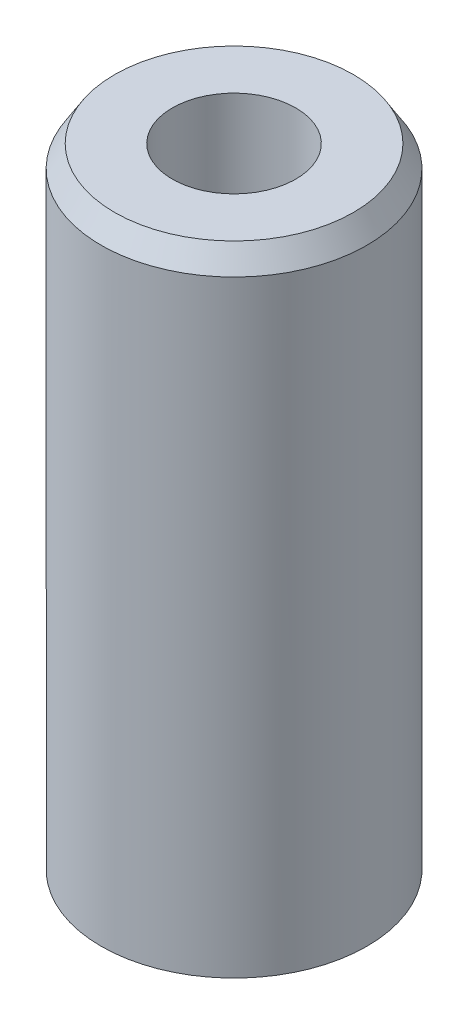
ISO-10303-21;
HEADER;
FILE_DESCRIPTION(('STEP AP214'),'2;1');
FILE_NAME('part.step','',(''),(''),'','','');
FILE_SCHEMA(('AUTOMOTIVE_DESIGN { 1 0 10303 214 1 1 1 1 }'));
ENDSEC;
DATA;
#1=APPLICATION_CONTEXT('core data for automotive mechanical design processes');
#2=APPLICATION_PROTOCOL_DEFINITION('international standard','automotive_design',2000,#1);
#3=PRODUCT_CONTEXT('',#1,'mechanical');
#4=PRODUCT('Part','Part','',(#3));
#5=PRODUCT_RELATED_PRODUCT_CATEGORY('part','',(#4));
#6=PRODUCT_DEFINITION_FORMATION('','',#4);
#7=PRODUCT_DEFINITION_CONTEXT('part definition',#1,'design');
#8=PRODUCT_DEFINITION('design','',#6,#7);
#9=PRODUCT_DEFINITION_SHAPE('','',#8);
#10=(LENGTH_UNIT() NAMED_UNIT(*) SI_UNIT(.MILLI.,.METRE.));
#11=(NAMED_UNIT(*) PLANE_ANGLE_UNIT() SI_UNIT($,.RADIAN.));
#12=(NAMED_UNIT(*) SI_UNIT($,.STERADIAN.) SOLID_ANGLE_UNIT());
#13=UNCERTAINTY_MEASURE_WITH_UNIT(LENGTH_MEASURE(1.E-05),#10,'distance_accuracy_value','');
#14=(GEOMETRIC_REPRESENTATION_CONTEXT(3) GLOBAL_UNCERTAINTY_ASSIGNED_CONTEXT((#13)) GLOBAL_UNIT_ASSIGNED_CONTEXT((#10,
#11,#12)) REPRESENTATION_CONTEXT('',''));
#15=CARTESIAN_POINT('',(0.,0.,0.));
#16=DIRECTION('',(0.,0.,1.));
#17=DIRECTION('',(1.,0.,0.));
#18=AXIS2_PLACEMENT_3D('',#15,#16,#17);
#19=CARTESIAN_POINT('',(0.,96.6680046645585,0.));
#20=DIRECTION('',(0.,-1.,0.));
#21=DIRECTION('',(0.,0.,-1.));
#22=AXIS2_PLACEMENT_3D('',#19,#20,#21);
#23=CYLINDRICAL_SURFACE('',#22,20.);
#24=CARTESIAN_POINT('',(0.,93.4012086567926,0.));
#25=DIRECTION('',(0.,1.,0.));
#26=DIRECTION('',(0.,0.,1.));
#27=AXIS2_PLACEMENT_3D('',#24,#25,#26);
#28=CIRCLE('',#27,20.);
#29=CARTESIAN_POINT('',(0.,93.4012086567926,-20.));
#30=VERTEX_POINT('',#29);
#31=EDGE_CURVE('E50',#30,#30,#28,.F.);
#32=CARTESIAN_POINT('',(0.,2.02536451260532,0.));
#33=DIRECTION('',(0.,1.,0.));
#34=DIRECTION('',(0.,0.,1.));
#35=AXIS2_PLACEMENT_3D('',#32,#33,#34);
#36=CIRCLE('',#35,20.);
#37=CARTESIAN_POINT('',(0.,2.02536451260532,-20.));
#38=VERTEX_POINT('',#37);
#39=EDGE_CURVE('E51',#38,#38,#36,.T.);
#40=CARTESIAN_POINT('',(0.,93.4012086567926,-20.));
#41=CARTESIAN_POINT('',(0.,92.4493769469573,-20.));
#42=CARTESIAN_POINT('',(0.,91.497545237122,-20.));
#43=CARTESIAN_POINT('',(0.,89.5938818174514,-20.));
#44=CARTESIAN_POINT('',(0.,88.6420501076162,-20.));
#45=CARTESIAN_POINT('',(0.,86.7383866879456,-20.));
#46=CARTESIAN_POINT('',(0.,85.7865549781103,-20.));
#47=CARTESIAN_POINT('',(0.,83.8828915584397,-20.));
#48=CARTESIAN_POINT('',(0.,82.9310598486044,-20.));
#49=CARTESIAN_POINT('',(0.,81.0273964289339,-20.));
#50=CARTESIAN_POINT('',(0.,80.0755647190986,-20.));
#51=CARTESIAN_POINT('',(0.,78.171901299428,-20.));
#52=CARTESIAN_POINT('',(0.,77.2200695895928,-20.));
#53=CARTESIAN_POINT('',(0.,75.3164061699222,-20.));
#54=CARTESIAN_POINT('',(0.,74.3645744600869,-20.));
#55=CARTESIAN_POINT('',(0.,72.4609110404163,-20.));
#56=CARTESIAN_POINT('',(0.,71.509079330581,-20.));
#57=CARTESIAN_POINT('',(0.,69.6054159109105,-20.));
#58=CARTESIAN_POINT('',(0.,68.6535842010752,-20.));
#59=CARTESIAN_POINT('',(0.,66.7499207814046,-20.));
#60=CARTESIAN_POINT('',(0.,65.7980890715693,-20.));
#61=CARTESIAN_POINT('',(0.,63.8944256518988,-20.));
#62=CARTESIAN_POINT('',(0.,62.9425939420635,-20.));
#63=CARTESIAN_POINT('',(0.,61.0389305223929,-20.));
#64=CARTESIAN_POINT('',(0.,60.0870988125576,-20.));
#65=CARTESIAN_POINT('',(0.,58.1834353928871,-20.));
#66=CARTESIAN_POINT('',(0.,57.2316036830518,-20.));
#67=CARTESIAN_POINT('',(0.,55.3279402633812,-20.));
#68=CARTESIAN_POINT('',(0.,54.3761085535459,-20.));
#69=CARTESIAN_POINT('',(0.,52.4724451338754,-20.));
#70=CARTESIAN_POINT('',(0.,51.5206134240401,-20.));
#71=CARTESIAN_POINT('',(0.,49.6169500043695,-20.));
#72=CARTESIAN_POINT('',(0.,48.6651182945342,-20.));
#73=CARTESIAN_POINT('',(0.,46.7614548748637,-20.));
#74=CARTESIAN_POINT('',(0.,45.8096231650284,-20.));
#75=CARTESIAN_POINT('',(0.,43.9059597453578,-20.));
#76=CARTESIAN_POINT('',(0.,42.9541280355225,-20.));
#77=CARTESIAN_POINT('',(0.,41.050464615852,-20.));
#78=CARTESIAN_POINT('',(0.,40.0986329060167,-20.));
#79=CARTESIAN_POINT('',(0.,38.1949694863461,-20.));
#80=CARTESIAN_POINT('',(0.,37.2431377765108,-20.));
#81=CARTESIAN_POINT('',(0.,35.3394743568403,-20.));
#82=CARTESIAN_POINT('',(0.,34.387642647005,-20.));
#83=CARTESIAN_POINT('',(0.,32.4839792273344,-20.));
#84=CARTESIAN_POINT('',(0.,31.5321475174991,-20.));
#85=CARTESIAN_POINT('',(0.,29.6284840978286,-20.));
#86=CARTESIAN_POINT('',(0.,28.6766523879933,-20.));
#87=CARTESIAN_POINT('',(0.,26.7729889683227,-20.));
#88=CARTESIAN_POINT('',(0.,25.8211572584874,-20.));
#89=CARTESIAN_POINT('',(0.,23.9174938388168,-20.));
#90=CARTESIAN_POINT('',(0.,22.9656621289816,-20.));
#91=CARTESIAN_POINT('',(0.,21.061998709311,-20.));
#92=CARTESIAN_POINT('',(0.,20.1101669994757,-20.));
#93=CARTESIAN_POINT('',(0.,18.2065035798052,-20.));
#94=CARTESIAN_POINT('',(0.,17.2546718699699,-20.));
#95=CARTESIAN_POINT('',(0.,15.3510084502993,-20.));
#96=CARTESIAN_POINT('',(0.,14.399176740464,-20.));
#97=CARTESIAN_POINT('',(0.,12.4955133207934,-20.));
#98=CARTESIAN_POINT('',(0.,11.5436816109582,-20.));
#99=CARTESIAN_POINT('',(0.,9.64001819128759,-20.));
#100=CARTESIAN_POINT('',(0.,8.6881864814523,-20.));
#101=CARTESIAN_POINT('',(0.,6.78452306178174,-20.));
#102=CARTESIAN_POINT('',(0.,5.83269135194645,-20.));
#103=CARTESIAN_POINT('',(0.,3.92902793227589,-20.));
#104=CARTESIAN_POINT('',(0.,2.97719622244061,-20.));
#105=CARTESIAN_POINT('',(0.,2.02536451260532,-20.));
#106=B_SPLINE_CURVE_WITH_KNOTS('',3,(#40,#41,#42,#43,#44,#45,#46,#47,#48,#49,#50,#51,#52,#53,
#54,#55,#56,#57,#58,#59,#60,#61,#62,#63,#64,#65,#66,#67,#68,#69,#70,#71,#72,#73,#74,#75,#76,#77,
#78,#79,#80,#81,#82,#83,#84,#85,#86,#87,#88,#89,#90,#91,#92,#93,#94,#95,#96,#97,#98,#99,#100,
#101,#102,#103,#104,#105),.UNSPECIFIED.,.F.,.F.,(4,2,2,2,2,2,2,2,2,2,2,2,2,2,2,2,2,2,2,2,2,2,2,
2,2,2,2,2,2,2,2,2,4),(0.,2.85549512950585,5.7109902590117,8.56648538851755,11.4219805180234,
14.2774756475293,17.1329707770351,19.9884659065409,22.8439610360468,25.6994561655527,
28.5549512950585,31.4104464245644,34.2659415540702,37.1214366835761,39.9769318130819,
42.8324269425878,45.6879220720936,48.5434172015995,51.3989123311053,54.2544074606112,
57.109902590117,59.9653977196229,62.8208928491287,65.6763879786346,68.5318831081404,
71.3873782376463,74.2428733671521,77.098368496658,79.9538636261638,82.8093587556697,
85.6648538851755,88.5203490146814,91.3758441441872),.UNSPECIFIED.);
#107=EDGE_CURVE('BSEAM39',#30,#38,#106,.T.);
#108=ORIENTED_EDGE('',*,*,#31,.T.);
#109=ORIENTED_EDGE('',*,*,#39,.T.);
#110=ORIENTED_EDGE('',*,*,#107,.T.);
#111=ORIENTED_EDGE('',*,*,#107,.F.);
#112=EDGE_LOOP('',(#108,#110,#109,#111));
#113=FACE_BOUND('',#112,.T.);
#114=ADVANCED_FACE('F39',(#113),#23,.T.);
#115=CARTESIAN_POINT('',(0.,96.6680046645585,0.));
#116=DIRECTION('',(0.,1.,0.));
#117=DIRECTION('',(0.,0.,1.));
#118=AXIS2_PLACEMENT_3D('',#115,#116,#117);
#119=PLANE('',#118);
#120=CARTESIAN_POINT('',(0.,96.6680046645585,0.));
#121=DIRECTION('',(0.,1.,0.));
#122=DIRECTION('',(0.,0.,1.));
#123=AXIS2_PLACEMENT_3D('',#120,#121,#122);
#124=CIRCLE('',#123,17.9746354873948);
#125=CARTESIAN_POINT('',(0.,96.6680046645585,17.9746354873948));
#126=VERTEX_POINT('',#125);
#127=EDGE_CURVE('E54',#126,#126,#124,.T.);
#128=ORIENTED_EDGE('',*,*,#127,.T.);
#129=EDGE_LOOP('',(#128));
#130=FACE_BOUND('',#129,.T.);
#131=CARTESIAN_POINT('',(0.,96.6680046645585,0.));
#132=DIRECTION('',(0.,1.,0.));
#133=DIRECTION('',(0.,0.,1.));
#134=AXIS2_PLACEMENT_3D('',#131,#132,#133);
#135=CIRCLE('',#134,9.29260788548895);
#136=CARTESIAN_POINT('',(0.,96.6680046645585,-9.29260788548895));
#137=VERTEX_POINT('',#136);
#138=EDGE_CURVE('E58',#137,#137,#135,.T.);
#139=ORIENTED_EDGE('',*,*,#138,.F.);
#140=EDGE_LOOP('',(#139));
#141=FACE_BOUND('',#140,.T.);
#142=ADVANCED_FACE('F69',(#130,#141),#119,.T.);
#143=CARTESIAN_POINT('',(0.,0.,0.));
#144=DIRECTION('',(0.,1.,0.));
#145=DIRECTION('',(0.,0.,1.));
#146=AXIS2_PLACEMENT_3D('',#143,#144,#145);
#147=PLANE('',#146);
#148=CARTESIAN_POINT('',(0.,0.,0.));
#149=DIRECTION('',(0.,1.,0.));
#150=DIRECTION('',(0.,0.,1.));
#151=AXIS2_PLACEMENT_3D('',#148,#149,#150);
#152=CIRCLE('',#151,16.7332039922339);
#153=CARTESIAN_POINT('',(0.,0.,16.7332039922339));
#154=VERTEX_POINT('',#153);
#155=EDGE_CURVE('E10',#154,#154,#152,.F.);
#156=ORIENTED_EDGE('',*,*,#155,.T.);
#157=EDGE_LOOP('',(#156));
#158=FACE_BOUND('',#157,.T.);
#159=CARTESIAN_POINT('',(0.,0.,0.));
#160=DIRECTION('',(0.,1.,0.));
#161=DIRECTION('',(0.,0.,1.));
#162=AXIS2_PLACEMENT_3D('',#159,#160,#161);
#163=CIRCLE('',#162,9.29260788548895);
#164=CARTESIAN_POINT('',(0.,0.,-9.29260788548895));
#165=VERTEX_POINT('',#164);
#166=EDGE_CURVE('E63',#165,#165,#163,.T.);
#167=ORIENTED_EDGE('',*,*,#166,.T.);
#168=EDGE_LOOP('',(#167));
#169=FACE_BOUND('',#168,.T.);
#170=ADVANCED_FACE('F75',(#158,#169),#147,.F.);
#171=CARTESIAN_POINT('',(0.,96.6680046645585,0.));
#172=DIRECTION('',(0.,-1.,0.));
#173=DIRECTION('',(0.,0.,-1.));
#174=AXIS2_PLACEMENT_3D('',#171,#172,#173);
#175=CYLINDRICAL_SURFACE('',#174,9.29260788548895);
#176=CARTESIAN_POINT('',(0.,96.6680046645585,-9.29260788548895));
#177=CARTESIAN_POINT('',(0.,95.661046282636,-9.29260788548895));
#178=CARTESIAN_POINT('',(0.,94.6540879007136,-9.29260788548895));
#179=CARTESIAN_POINT('',(0.,92.6401711368686,-9.29260788548895));
#180=CARTESIAN_POINT('',(0.,91.6332127549461,-9.29260788548895));
#181=CARTESIAN_POINT('',(0.,89.6192959911011,-9.29260788548895));
#182=CARTESIAN_POINT('',(0.,88.6123376091787,-9.29260788548895));
#183=CARTESIAN_POINT('',(0.,86.5984208453337,-9.29260788548895));
#184=CARTESIAN_POINT('',(0.,85.5914624634112,-9.29260788548895));
#185=CARTESIAN_POINT('',(0.,83.5775456995662,-9.29260788548895));
#186=CARTESIAN_POINT('',(0.,82.5705873176437,-9.29260788548895));
#187=CARTESIAN_POINT('',(0.,80.5566705537988,-9.29260788548895));
#188=CARTESIAN_POINT('',(0.,79.5497121718763,-9.29260788548895));
#189=CARTESIAN_POINT('',(0.,77.5357954080313,-9.29260788548895));
#190=CARTESIAN_POINT('',(0.,76.5288370261088,-9.29260788548895));
#191=CARTESIAN_POINT('',(0.,74.5149202622639,-9.29260788548895));
#192=CARTESIAN_POINT('',(0.,73.5079618803414,-9.29260788548895));
#193=CARTESIAN_POINT('',(0.,71.4940451164964,-9.29260788548895));
#194=CARTESIAN_POINT('',(0.,70.4870867345739,-9.29260788548895));
#195=CARTESIAN_POINT('',(0.,68.473169970729,-9.29260788548895));
#196=CARTESIAN_POINT('',(0.,67.4662115888065,-9.29260788548895));
#197=CARTESIAN_POINT('',(0.,65.4522948249615,-9.29260788548895));
#198=CARTESIAN_POINT('',(0.,64.445336443039,-9.29260788548895));
#199=CARTESIAN_POINT('',(0.,62.4314196791941,-9.29260788548895));
#200=CARTESIAN_POINT('',(0.,61.4244612972716,-9.29260788548895));
#201=CARTESIAN_POINT('',(0.,59.4105445334266,-9.29260788548895));
#202=CARTESIAN_POINT('',(0.,58.4035861515041,-9.29260788548895));
#203=CARTESIAN_POINT('',(0.,56.3896693876591,-9.29260788548895));
#204=CARTESIAN_POINT('',(0.,55.3827110057367,-9.29260788548895));
#205=CARTESIAN_POINT('',(0.,53.3687942418917,-9.29260788548895));
#206=CARTESIAN_POINT('',(0.,52.3618358599692,-9.29260788548895));
#207=CARTESIAN_POINT('',(0.,50.3479190961242,-9.29260788548895));
#208=CARTESIAN_POINT('',(0.,49.3409607142017,-9.29260788548895));
#209=CARTESIAN_POINT('',(0.,47.3270439503568,-9.29260788548895));
#210=CARTESIAN_POINT('',(0.,46.3200855684343,-9.29260788548895));
#211=CARTESIAN_POINT('',(0.,44.3061688045893,-9.29260788548895));
#212=CARTESIAN_POINT('',(0.,43.2992104226668,-9.29260788548895));
#213=CARTESIAN_POINT('',(0.,41.2852936588219,-9.29260788548895));
#214=CARTESIAN_POINT('',(0.,40.2783352768994,-9.29260788548895));
#215=CARTESIAN_POINT('',(0.,38.2644185130544,-9.29260788548895));
#216=CARTESIAN_POINT('',(0.,37.2574601311319,-9.29260788548895));
#217=CARTESIAN_POINT('',(0.,35.243543367287,-9.29260788548895));
#218=CARTESIAN_POINT('',(0.,34.2365849853645,-9.29260788548895));
#219=CARTESIAN_POINT('',(0.,32.2226682215195,-9.29260788548895));
#220=CARTESIAN_POINT('',(0.,31.215709839597,-9.29260788548895));
#221=CARTESIAN_POINT('',(0.,29.2017930757521,-9.29260788548895));
#222=CARTESIAN_POINT('',(0.,28.1948346938296,-9.29260788548895));
#223=CARTESIAN_POINT('',(0.,26.1809179299846,-9.29260788548895));
#224=CARTESIAN_POINT('',(0.,25.1739595480621,-9.29260788548895));
#225=CARTESIAN_POINT('',(0.,23.1600427842172,-9.29260788548895));
#226=CARTESIAN_POINT('',(0.,22.1530844022947,-9.29260788548895));
#227=CARTESIAN_POINT('',(0.,20.1391676384497,-9.29260788548895));
#228=CARTESIAN_POINT('',(0.,19.1322092565272,-9.29260788548895));
#229=CARTESIAN_POINT('',(0.,17.1182924926822,-9.29260788548895));
#230=CARTESIAN_POINT('',(0.,16.1113341107598,-9.29260788548895));
#231=CARTESIAN_POINT('',(0.,14.0974173469148,-9.29260788548895));
#232=CARTESIAN_POINT('',(0.,13.0904589649923,-9.29260788548895));
#233=CARTESIAN_POINT('',(0.,11.0765422011473,-9.29260788548895));
#234=CARTESIAN_POINT('',(0.,10.0695838192248,-9.29260788548895));
#235=CARTESIAN_POINT('',(0.,8.05566705537988,-9.29260788548895));
#236=CARTESIAN_POINT('',(0.,7.04870867345739,-9.29260788548895));
#237=CARTESIAN_POINT('',(0.,5.03479190961242,-9.29260788548895));
#238=CARTESIAN_POINT('',(0.,4.02783352768994,-9.29260788548895));
#239=CARTESIAN_POINT('',(0.,2.01391676384497,-9.29260788548895));
#240=CARTESIAN_POINT('',(0.,1.00695838192249,-9.29260788548895));
#241=CARTESIAN_POINT('',(0.,0.,-9.29260788548895));
#242=B_SPLINE_CURVE_WITH_KNOTS('',3,(#176,#177,#178,#179,#180,#181,#182,#183,#184,#185,#186,
#187,#188,#189,#190,#191,#192,#193,#194,#195,#196,#197,#198,#199,#200,#201,#202,#203,#204,#205,
#206,#207,#208,#209,#210,#211,#212,#213,#214,#215,#216,#217,#218,#219,#220,#221,#222,#223,#224,
#225,#226,#227,#228,#229,#230,#231,#232,#233,#234,#235,#236,#237,#238,#239,#240,#241),
.UNSPECIFIED.,.F.,.F.,(4,2,2,2,2,2,2,2,2,2,2,2,2,2,2,2,2,2,2,2,2,2,2,2,2,2,2,2,2,2,2,2,4),(0.,
3.02087514576745,6.04175029153491,9.06262543730235,12.0835005830698,15.1043757288373,
18.1252508746047,21.1461260203722,24.1670011661396,27.1878763119071,30.2087514576745,
33.229626603442,36.2505017492094,39.2713768949769,42.2922520407443,45.3131271865118,
48.3340023322793,51.3548774780467,54.3757526238142,57.3966277695816,60.4175029153491,
63.4383780611165,66.459253206884,69.4801283526514,72.5010034984189,75.5218786441863,
78.5427537899538,81.5636289357213,84.5845040814887,87.6053792272562,90.6262543730236,
93.6471295187911,96.6680046645585),.UNSPECIFIED.);
#243=EDGE_CURVE('BSEAM70',#137,#165,#242,.T.);
#244=ORIENTED_EDGE('',*,*,#138,.T.);
#245=ORIENTED_EDGE('',*,*,#166,.F.);
#246=ORIENTED_EDGE('',*,*,#243,.T.);
#247=ORIENTED_EDGE('',*,*,#243,.F.);
#248=EDGE_LOOP('',(#244,#246,#245,#247));
#249=FACE_BOUND('',#248,.T.);
#250=ADVANCED_FACE('F70',(#249),#175,.F.);
#251=CARTESIAN_POINT('',(0.,96.6680046645585,0.));
#252=DIRECTION('',(0.,-1.,0.));
#253=DIRECTION('',(0.,0.,-1.));
#254=AXIS2_PLACEMENT_3D('',#251,#252,#253);
#255=CONICAL_SURFACE('',#254,17.9746354873948,0.554984889976249);
#256=ORIENTED_EDGE('',*,*,#31,.F.);
#257=EDGE_LOOP('',(#256));
#258=FACE_BOUND('',#257,.T.);
#259=ORIENTED_EDGE('',*,*,#127,.F.);
#260=EDGE_LOOP('',(#259));
#261=FACE_BOUND('',#260,.T.);
#262=ADVANCED_FACE('F81',(#258,#261),#255,.T.);
#263=CARTESIAN_POINT('',(0.,2.02536451260532,0.));
#264=DIRECTION('',(0.,1.,0.));
#265=DIRECTION('',(0.,0.,1.));
#266=AXIS2_PLACEMENT_3D('',#263,#264,#265);
#267=CONICAL_SURFACE('',#266,20.,1.01581143681865);
#268=ORIENTED_EDGE('',*,*,#155,.F.);
#269=EDGE_LOOP('',(#268));
#270=FACE_BOUND('',#269,.T.);
#271=ORIENTED_EDGE('',*,*,#39,.F.);
#272=EDGE_LOOP('',(#271));
#273=FACE_BOUND('',#272,.T.);
#274=ADVANCED_FACE('F45',(#270,#273),#267,.T.);
#275=CLOSED_SHELL('',(#114,#142,#170,#250,#262,#274));
#276=MANIFOLD_SOLID_BREP('B2',#275);
#277=ADVANCED_BREP_SHAPE_REPRESENTATION('',(#18,#276),#14);
#278=SHAPE_DEFINITION_REPRESENTATION(#9,#277);
ENDSEC;
END-ISO-10303-21;
